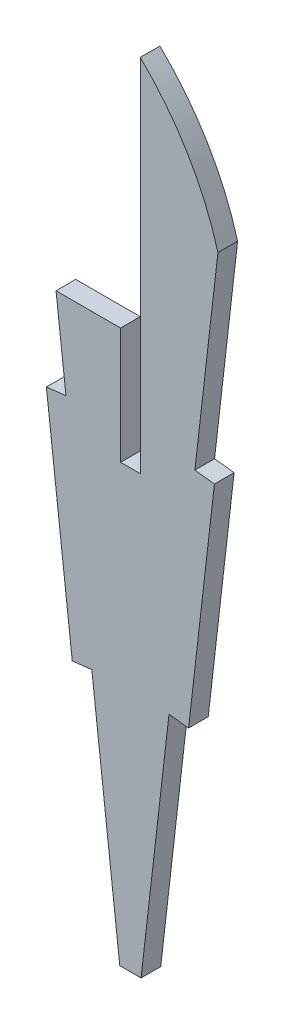
ISO-10303-21;
HEADER;
FILE_DESCRIPTION(('STEP AP214'),'2;1');
FILE_NAME('part.step','',(''),(''),'','','');
FILE_SCHEMA(('AUTOMOTIVE_DESIGN { 1 0 10303 214 1 1 1 1 }'));
ENDSEC;
DATA;
#1=APPLICATION_CONTEXT('core data for automotive mechanical design processes');
#2=APPLICATION_PROTOCOL_DEFINITION('international standard','automotive_design',2000,#1);
#3=PRODUCT_CONTEXT('',#1,'mechanical');
#4=PRODUCT('Part','Part','',(#3));
#5=PRODUCT_RELATED_PRODUCT_CATEGORY('part','',(#4));
#6=PRODUCT_DEFINITION_FORMATION('','',#4);
#7=PRODUCT_DEFINITION_CONTEXT('part definition',#1,'design');
#8=PRODUCT_DEFINITION('design','',#6,#7);
#9=PRODUCT_DEFINITION_SHAPE('','',#8);
#10=(LENGTH_UNIT() NAMED_UNIT(*) SI_UNIT(.MILLI.,.METRE.));
#11=(NAMED_UNIT(*) PLANE_ANGLE_UNIT() SI_UNIT($,.RADIAN.));
#12=(NAMED_UNIT(*) SI_UNIT($,.STERADIAN.) SOLID_ANGLE_UNIT());
#13=UNCERTAINTY_MEASURE_WITH_UNIT(LENGTH_MEASURE(1.E-05),#10,'distance_accuracy_value','');
#14=(GEOMETRIC_REPRESENTATION_CONTEXT(3) GLOBAL_UNCERTAINTY_ASSIGNED_CONTEXT((#13)) GLOBAL_UNIT_ASSIGNED_CONTEXT((#10,
#11,#12)) REPRESENTATION_CONTEXT('',''));
#15=CARTESIAN_POINT('',(0.,0.,0.));
#16=DIRECTION('',(0.,0.,1.));
#17=DIRECTION('',(1.,0.,0.));
#18=AXIS2_PLACEMENT_3D('',#15,#16,#17);
#19=CARTESIAN_POINT('',(-1.58511702127161,-218.846004156376,1.524));
#20=DIRECTION('',(0.,1.,0.));
#21=DIRECTION('',(0.,0.,1.));
#22=AXIS2_PLACEMENT_3D('',#19,#20,#21);
#23=PLANE('',#22);
#24=DIRECTION('',(1.,0.,0.));
#25=VECTOR('',#24,1.);
#26=CARTESIAN_POINT('',(-1.58511702127161,-218.846004156376,0.));
#27=LINE('',#26,#25);
#28=CARTESIAN_POINT('',(-1.58511702127161,-218.846004156376,0.));
#29=VERTEX_POINT('',#28);
#30=CARTESIAN_POINT('',(0.0611170212716098,-218.846004156376,0.));
#31=VERTEX_POINT('',#30);
#32=EDGE_CURVE('E187',#29,#31,#27,.T.);
#33=ORIENTED_EDGE('',*,*,#32,.T.);
#34=DIRECTION('',(0.,0.,-1.));
#35=VECTOR('',#34,1.);
#36=CARTESIAN_POINT('',(0.0611170212716098,-218.846004156376,1.524));
#37=LINE('',#36,#35);
#38=CARTESIAN_POINT('',(0.0611170212716098,-218.846004156376,1.524));
#39=VERTEX_POINT('',#38);
#40=EDGE_CURVE('E50',#39,#31,#37,.T.);
#41=ORIENTED_EDGE('',*,*,#40,.F.);
#42=DIRECTION('',(1.,0.,0.));
#43=VECTOR('',#42,1.);
#44=CARTESIAN_POINT('',(-1.58511702127161,-218.846004156376,1.524));
#45=LINE('',#44,#43);
#46=CARTESIAN_POINT('',(-1.58511702127161,-218.846004156376,1.524));
#47=VERTEX_POINT('',#46);
#48=EDGE_CURVE('E218',#47,#39,#45,.T.);
#49=ORIENTED_EDGE('',*,*,#48,.F.);
#50=DIRECTION('',(0.,0.,-1.));
#51=VECTOR('',#50,1.);
#52=CARTESIAN_POINT('',(-1.58511702127161,-218.846004156376,1.524));
#53=LINE('',#52,#51);
#54=EDGE_CURVE('E183',#47,#29,#53,.T.);
#55=ORIENTED_EDGE('',*,*,#54,.T.);
#56=EDGE_LOOP('',(#33,#41,#49,#55));
#57=FACE_BOUND('',#56,.T.);
#58=ADVANCED_FACE('F43',(#57),#23,.F.);
#59=CARTESIAN_POINT('',(2.22566948418233,-200.077957006271,1.524));
#60=DIRECTION('',(-0.993414910122723,0.114572319282901,0.));
#61=DIRECTION('',(-0.114572319282901,-0.993414910122723,0.));
#62=AXIS2_PLACEMENT_3D('',#59,#60,#61);
#63=PLANE('',#62);
#64=DIRECTION('',(0.114572319282901,0.993414910122723,0.));
#65=VECTOR('',#64,1.);
#66=CARTESIAN_POINT('',(2.22566948418233,-200.077957006271,0.));
#67=LINE('',#66,#65);
#68=CARTESIAN_POINT('',(2.22566948418233,-200.077957006271,0.));
#69=VERTEX_POINT('',#68);
#70=EDGE_CURVE('E190',#31,#69,#67,.T.);
#71=ORIENTED_EDGE('',*,*,#70,.T.);
#72=DIRECTION('',(0.,0.,-1.));
#73=VECTOR('',#72,1.);
#74=CARTESIAN_POINT('',(2.22566948418233,-200.077957006271,1.524));
#75=LINE('',#74,#73);
#76=CARTESIAN_POINT('',(2.22566948418233,-200.077957006271,1.524));
#77=VERTEX_POINT('',#76);
#78=EDGE_CURVE('E246',#77,#69,#75,.T.);
#79=ORIENTED_EDGE('',*,*,#78,.F.);
#80=DIRECTION('',(0.114572319282901,0.993414910122723,0.));
#81=VECTOR('',#80,1.);
#82=CARTESIAN_POINT('',(2.22566948418233,-200.077957006271,1.524));
#83=LINE('',#82,#81);
#84=EDGE_CURVE('E125',#39,#77,#83,.T.);
#85=ORIENTED_EDGE('',*,*,#84,.F.);
#86=ORIENTED_EDGE('',*,*,#40,.T.);
#87=EDGE_LOOP('',(#71,#79,#85,#86));
#88=FACE_BOUND('',#87,.T.);
#89=ADVANCED_FACE('F249',(#88),#63,.F.);
#90=CARTESIAN_POINT('',(2.22566948418233,-200.077957006271,1.524));
#91=DIRECTION('',(0.114572319282904,0.993414910122722,0.));
#92=DIRECTION('',(-0.993414910122722,0.114572319282904,0.));
#93=AXIS2_PLACEMENT_3D('',#90,#91,#92);
#94=PLANE('',#93);
#95=DIRECTION('',(0.993414910122722,-0.114572319282904,0.));
#96=VECTOR('',#95,1.);
#97=CARTESIAN_POINT('',(2.22566948418233,-200.077957006271,0.));
#98=LINE('',#97,#96);
#99=CARTESIAN_POINT('',(3.73963380720936,-200.252565220858,0.));
#100=VERTEX_POINT('',#99);
#101=EDGE_CURVE('E193',#69,#100,#98,.T.);
#102=ORIENTED_EDGE('',*,*,#101,.T.);
#103=DIRECTION('',(0.,0.,-1.));
#104=VECTOR('',#103,1.);
#105=CARTESIAN_POINT('',(3.73963380720936,-200.252565220858,1.524));
#106=LINE('',#105,#104);
#107=CARTESIAN_POINT('',(3.73963380720936,-200.252565220858,1.524));
#108=VERTEX_POINT('',#107);
#109=EDGE_CURVE('E243',#108,#100,#106,.T.);
#110=ORIENTED_EDGE('',*,*,#109,.F.);
#111=DIRECTION('',(0.993414910122722,-0.114572319282904,0.));
#112=VECTOR('',#111,1.);
#113=CARTESIAN_POINT('',(2.22566948418233,-200.077957006271,1.524));
#114=LINE('',#113,#112);
#115=EDGE_CURVE('E270',#77,#108,#114,.T.);
#116=ORIENTED_EDGE('',*,*,#115,.F.);
#117=ORIENTED_EDGE('',*,*,#78,.T.);
#118=EDGE_LOOP('',(#102,#110,#116,#117));
#119=FACE_BOUND('',#118,.T.);
#120=ADVANCED_FACE('F261',(#119),#94,.F.);
#121=CARTESIAN_POINT('',(5.74289991185404,-182.882973422829,1.524));
#122=DIRECTION('',(-0.993414910122723,0.114572319282902,0.));
#123=DIRECTION('',(-0.114572319282902,-0.993414910122723,0.));
#124=AXIS2_PLACEMENT_3D('',#121,#122,#123);
#125=PLANE('',#124);
#126=DIRECTION('',(0.114572319282902,0.993414910122722,0.));
#127=VECTOR('',#126,1.);
#128=CARTESIAN_POINT('',(5.74289991185404,-182.882973422829,0.));
#129=LINE('',#128,#127);
#130=CARTESIAN_POINT('',(5.74289991185404,-182.882973422829,0.));
#131=VERTEX_POINT('',#130);
#132=EDGE_CURVE('E195',#100,#131,#129,.T.);
#133=ORIENTED_EDGE('',*,*,#132,.T.);
#134=DIRECTION('',(0.,0.,-1.));
#135=VECTOR('',#134,1.);
#136=CARTESIAN_POINT('',(5.74289991185404,-182.882973422829,1.524));
#137=LINE('',#136,#135);
#138=CARTESIAN_POINT('',(5.74289991185404,-182.882973422829,1.524));
#139=VERTEX_POINT('',#138);
#140=EDGE_CURVE('E240',#139,#131,#137,.T.);
#141=ORIENTED_EDGE('',*,*,#140,.F.);
#142=DIRECTION('',(0.114572319282902,0.993414910122722,0.));
#143=VECTOR('',#142,1.);
#144=CARTESIAN_POINT('',(5.74289991185404,-182.882973422829,1.524));
#145=LINE('',#144,#143);
#146=EDGE_CURVE('E267',#108,#139,#145,.T.);
#147=ORIENTED_EDGE('',*,*,#146,.F.);
#148=ORIENTED_EDGE('',*,*,#109,.T.);
#149=EDGE_LOOP('',(#133,#141,#147,#148));
#150=FACE_BOUND('',#149,.T.);
#151=ADVANCED_FACE('F265',(#150),#125,.F.);
#152=CARTESIAN_POINT('',(4.228935588827,-182.708365208241,1.524));
#153=DIRECTION('',(-0.114572319282922,-0.99341491012272,0.));
#154=DIRECTION('',(0.99341491012272,-0.114572319282922,0.));
#155=AXIS2_PLACEMENT_3D('',#152,#153,#154);
#156=PLANE('',#155);
#157=DIRECTION('',(-0.99341491012272,0.114572319282922,0.));
#158=VECTOR('',#157,1.);
#159=CARTESIAN_POINT('',(4.228935588827,-182.708365208241,0.));
#160=LINE('',#159,#158);
#161=CARTESIAN_POINT('',(4.228935588827,-182.708365208241,0.));
#162=VERTEX_POINT('',#161);
#163=EDGE_CURVE('E197',#131,#162,#160,.T.);
#164=ORIENTED_EDGE('',*,*,#163,.T.);
#165=DIRECTION('',(0.,0.,-1.));
#166=VECTOR('',#165,1.);
#167=CARTESIAN_POINT('',(4.228935588827,-182.708365208241,1.524));
#168=LINE('',#167,#166);
#169=CARTESIAN_POINT('',(4.228935588827,-182.708365208241,1.524));
#170=VERTEX_POINT('',#169);
#171=EDGE_CURVE('E237',#170,#162,#168,.T.);
#172=ORIENTED_EDGE('',*,*,#171,.F.);
#173=DIRECTION('',(-0.99341491012272,0.114572319282922,0.));
#174=VECTOR('',#173,1.);
#175=CARTESIAN_POINT('',(4.228935588827,-182.708365208241,1.524));
#176=LINE('',#175,#174);
#177=EDGE_CURVE('E269',#139,#170,#176,.T.);
#178=ORIENTED_EDGE('',*,*,#177,.F.);
#179=ORIENTED_EDGE('',*,*,#140,.T.);
#180=EDGE_LOOP('',(#164,#172,#178,#179));
#181=FACE_BOUND('',#180,.T.);
#182=ADVANCED_FACE('F333',(#181),#156,.F.);
#183=CARTESIAN_POINT('',(6.01355397832156,-167.23458822529,1.524));
#184=DIRECTION('',(-0.993414910122723,0.114572319282901,0.));
#185=DIRECTION('',(-0.114572319282901,-0.993414910122723,0.));
#186=AXIS2_PLACEMENT_3D('',#183,#184,#185);
#187=PLANE('',#186);
#188=DIRECTION('',(0.114572319282901,0.993414910122723,0.));
#189=VECTOR('',#188,1.);
#190=CARTESIAN_POINT('',(6.01355397832156,-167.23458822529,0.));
#191=LINE('',#190,#189);
#192=CARTESIAN_POINT('',(6.01355397832155,-167.23458822529,0.));
#193=VERTEX_POINT('',#192);
#194=EDGE_CURVE('E199',#162,#193,#191,.T.);
#195=ORIENTED_EDGE('',*,*,#194,.T.);
#196=DIRECTION('',(0.,0.,-1.));
#197=VECTOR('',#196,1.);
#198=CARTESIAN_POINT('',(6.01355397832155,-167.23458822529,1.524));
#199=LINE('',#198,#197);
#200=CARTESIAN_POINT('',(6.01355397832155,-167.23458822529,1.524));
#201=VERTEX_POINT('',#200);
#202=EDGE_CURVE('E234',#201,#193,#199,.T.);
#203=ORIENTED_EDGE('',*,*,#202,.F.);
#204=DIRECTION('',(0.114572319282901,0.993414910122723,0.));
#205=VECTOR('',#204,1.);
#206=CARTESIAN_POINT('',(6.01355397832156,-167.23458822529,1.524));
#207=LINE('',#206,#205);
#208=EDGE_CURVE('E272',#170,#201,#207,.T.);
#209=ORIENTED_EDGE('',*,*,#208,.F.);
#210=ORIENTED_EDGE('',*,*,#171,.T.);
#211=EDGE_LOOP('',(#195,#203,#209,#210));
#212=FACE_BOUND('',#211,.T.);
#213=ADVANCED_FACE('F330',(#212),#187,.F.);
#214=CARTESIAN_POINT('',(-15.559815132406,-173.267487686723,1.524));
#215=DIRECTION('',(0.,0.,-1.));
#216=DIRECTION('',(-1.,0.,0.));
#217=AXIS2_PLACEMENT_3D('',#214,#215,#216);
#218=CYLINDRICAL_SURFACE('',#217,22.4010296794468);
#219=CARTESIAN_POINT('',(-15.559815132406,-173.267487686723,0.));
#220=DIRECTION('',(0.,0.,1.));
#221=DIRECTION('',(1.,0.,0.));
#222=AXIS2_PLACEMENT_3D('',#219,#220,#221);
#223=CIRCLE('',#222,22.4010296794468);
#224=CARTESIAN_POINT('',(0.,-157.152330729846,0.));
#225=VERTEX_POINT('',#224);
#226=EDGE_CURVE('E201',#193,#225,#223,.T.);
#227=ORIENTED_EDGE('',*,*,#226,.T.);
#228=DIRECTION('',(0.,0.,-1.));
#229=VECTOR('',#228,1.);
#230=CARTESIAN_POINT('',(0.,-157.152330729846,1.524));
#231=LINE('',#230,#229);
#232=CARTESIAN_POINT('',(0.,-157.152330729846,1.524));
#233=VERTEX_POINT('',#232);
#234=EDGE_CURVE('E231',#233,#225,#231,.T.);
#235=ORIENTED_EDGE('',*,*,#234,.F.);
#236=CARTESIAN_POINT('',(-15.559815132406,-173.267487686723,1.524));
#237=DIRECTION('',(0.,0.,1.));
#238=DIRECTION('',(1.,0.,0.));
#239=AXIS2_PLACEMENT_3D('',#236,#237,#238);
#240=CIRCLE('',#239,22.4010296794468);
#241=EDGE_CURVE('E278',#201,#233,#240,.T.);
#242=ORIENTED_EDGE('',*,*,#241,.F.);
#243=ORIENTED_EDGE('',*,*,#202,.T.);
#244=EDGE_LOOP('',(#227,#235,#242,#243));
#245=FACE_BOUND('',#244,.T.);
#246=ADVANCED_FACE('F326',(#245),#218,.T.);
#247=CARTESIAN_POINT('',(0.,-185.062075143658,1.524));
#248=DIRECTION('',(1.,0.,0.));
#249=DIRECTION('',(0.,1.,0.));
#250=AXIS2_PLACEMENT_3D('',#247,#248,#249);
#251=PLANE('',#250);
#252=DIRECTION('',(0.,-1.,0.));
#253=VECTOR('',#252,1.);
#254=CARTESIAN_POINT('',(0.,-185.062075143658,0.));
#255=LINE('',#254,#253);
#256=CARTESIAN_POINT('',(0.,-185.062075143658,0.));
#257=VERTEX_POINT('',#256);
#258=EDGE_CURVE('E203',#225,#257,#255,.T.);
#259=ORIENTED_EDGE('',*,*,#258,.T.);
#260=DIRECTION('',(0.,0.,-1.));
#261=VECTOR('',#260,1.);
#262=CARTESIAN_POINT('',(0.,-185.062075143658,1.524));
#263=LINE('',#262,#261);
#264=CARTESIAN_POINT('',(0.,-185.062075143658,1.524));
#265=VERTEX_POINT('',#264);
#266=EDGE_CURVE('E228',#265,#257,#263,.T.);
#267=ORIENTED_EDGE('',*,*,#266,.F.);
#268=DIRECTION('',(0.,-1.,0.));
#269=VECTOR('',#268,1.);
#270=CARTESIAN_POINT('',(0.,-185.062075143658,1.524));
#271=LINE('',#270,#269);
#272=EDGE_CURVE('E280',#233,#265,#271,.T.);
#273=ORIENTED_EDGE('',*,*,#272,.F.);
#274=ORIENTED_EDGE('',*,*,#234,.T.);
#275=EDGE_LOOP('',(#259,#267,#273,#274));
#276=FACE_BOUND('',#275,.T.);
#277=ADVANCED_FACE('F322',(#276),#251,.F.);
#278=CARTESIAN_POINT('',(0.,-185.062075143658,1.524));
#279=DIRECTION('',(0.,-1.,0.));
#280=DIRECTION('',(0.,0.,-1.));
#281=AXIS2_PLACEMENT_3D('',#278,#279,#280);
#282=PLANE('',#281);
#283=DIRECTION('',(-1.,0.,0.));
#284=VECTOR('',#283,1.);
#285=CARTESIAN_POINT('',(0.,-185.062075143658,0.));
#286=LINE('',#285,#284);
#287=CARTESIAN_POINT('',(-1.524,-185.062075143658,0.));
#288=VERTEX_POINT('',#287);
#289=EDGE_CURVE('E205',#257,#288,#286,.T.);
#290=ORIENTED_EDGE('',*,*,#289,.T.);
#291=DIRECTION('',(0.,0.,-1.));
#292=VECTOR('',#291,1.);
#293=CARTESIAN_POINT('',(-1.524,-185.062075143658,1.524));
#294=LINE('',#293,#292);
#295=CARTESIAN_POINT('',(-1.524,-185.062075143658,1.524));
#296=VERTEX_POINT('',#295);
#297=EDGE_CURVE('E225',#296,#288,#294,.T.);
#298=ORIENTED_EDGE('',*,*,#297,.F.);
#299=DIRECTION('',(-1.,0.,0.));
#300=VECTOR('',#299,1.);
#301=CARTESIAN_POINT('',(0.,-185.062075143658,1.524));
#302=LINE('',#301,#300);
#303=EDGE_CURVE('E282',#265,#296,#302,.T.);
#304=ORIENTED_EDGE('',*,*,#303,.F.);
#305=ORIENTED_EDGE('',*,*,#266,.T.);
#306=EDGE_LOOP('',(#290,#298,#304,#305));
#307=FACE_BOUND('',#306,.T.);
#308=ADVANCED_FACE('F316',(#307),#282,.F.);
#309=CARTESIAN_POINT('',(-1.524,-185.062075143658,1.524));
#310=DIRECTION('',(-1.,0.,0.));
#311=DIRECTION('',(0.,-1.,0.));
#312=AXIS2_PLACEMENT_3D('',#309,#310,#311);
#313=PLANE('',#312);
#314=DIRECTION('',(0.,1.,0.));
#315=VECTOR('',#314,1.);
#316=CARTESIAN_POINT('',(-1.524,-185.062075143658,0.));
#317=LINE('',#316,#315);
#318=CARTESIAN_POINT('',(-1.524,-176.059169336281,0.));
#319=VERTEX_POINT('',#318);
#320=EDGE_CURVE('E207',#288,#319,#317,.T.);
#321=ORIENTED_EDGE('',*,*,#320,.T.);
#322=DIRECTION('',(0.,0.,1.));
#323=VECTOR('',#322,1.);
#324=CARTESIAN_POINT('',(-1.524,-176.059169336281,0.));
#325=LINE('',#324,#323);
#326=CARTESIAN_POINT('',(-1.524,-176.059169336281,1.524));
#327=VERTEX_POINT('',#326);
#328=EDGE_CURVE('E57',#319,#327,#325,.T.);
#329=ORIENTED_EDGE('',*,*,#328,.T.);
#330=DIRECTION('',(0.,1.,0.));
#331=VECTOR('',#330,1.);
#332=CARTESIAN_POINT('',(-1.524,-185.062075143658,1.524));
#333=LINE('',#332,#331);
#334=EDGE_CURVE('E284',#296,#327,#333,.T.);
#335=ORIENTED_EDGE('',*,*,#334,.F.);
#336=ORIENTED_EDGE('',*,*,#297,.T.);
#337=EDGE_LOOP('',(#321,#329,#335,#336));
#338=FACE_BOUND('',#337,.T.);
#339=ADVANCED_FACE('F309',(#338),#313,.F.);
#340=CARTESIAN_POINT('',(-7.53755397832156,-167.23458822529,1.524));
#341=DIRECTION('',(0.993414910122723,0.114572319282901,0.));
#342=DIRECTION('',(-0.114572319282901,0.993414910122723,0.));
#343=AXIS2_PLACEMENT_3D('',#340,#341,#342);
#344=PLANE('',#343);
#345=DIRECTION('',(0.114572319282901,-0.993414910122723,0.));
#346=VECTOR('',#345,1.);
#347=CARTESIAN_POINT('',(-7.53755397832156,-167.23458822529,1.524));
#348=LINE('',#347,#346);
#349=CARTESIAN_POINT('',(-6.51979924735891,-176.059169336281,1.524));
#350=VERTEX_POINT('',#349);
#351=CARTESIAN_POINT('',(-5.75293558882701,-182.708365208241,1.524));
#352=VERTEX_POINT('',#351);
#353=EDGE_CURVE('E287',#350,#352,#348,.T.);
#354=ORIENTED_EDGE('',*,*,#353,.F.);
#355=DIRECTION('',(0.,0.,-1.));
#356=VECTOR('',#355,1.);
#357=CARTESIAN_POINT('',(-6.51979924735892,-176.059169336281,1.524));
#358=LINE('',#357,#356);
#359=CARTESIAN_POINT('',(-6.51979924735891,-176.059169336281,0.));
#360=VERTEX_POINT('',#359);
#361=EDGE_CURVE('E191',#350,#360,#358,.T.);
#362=ORIENTED_EDGE('',*,*,#361,.T.);
#363=DIRECTION('',(0.114572319282901,-0.993414910122723,0.));
#364=VECTOR('',#363,1.);
#365=CARTESIAN_POINT('',(-7.53755397832156,-167.23458822529,0.));
#366=LINE('',#365,#364);
#367=CARTESIAN_POINT('',(-5.75293558882701,-182.708365208241,0.));
#368=VERTEX_POINT('',#367);
#369=EDGE_CURVE('E210',#360,#368,#366,.T.);
#370=ORIENTED_EDGE('',*,*,#369,.T.);
#371=DIRECTION('',(0.,0.,-1.));
#372=VECTOR('',#371,1.);
#373=CARTESIAN_POINT('',(-5.75293558882701,-182.708365208241,1.524));
#374=LINE('',#373,#372);
#375=EDGE_CURVE('E222',#352,#368,#374,.T.);
#376=ORIENTED_EDGE('',*,*,#375,.F.);
#377=EDGE_LOOP('',(#354,#362,#370,#376));
#378=FACE_BOUND('',#377,.T.);
#379=ADVANCED_FACE('F294',(#378),#344,.F.);
#380=CARTESIAN_POINT('',(-5.75293558882701,-182.708365208241,1.524));
#381=DIRECTION('',(0.114572319282922,-0.99341491012272,0.));
#382=DIRECTION('',(0.99341491012272,0.114572319282922,0.));
#383=AXIS2_PLACEMENT_3D('',#380,#381,#382);
#384=PLANE('',#383);
#385=DIRECTION('',(-0.99341491012272,-0.114572319282922,0.));
#386=VECTOR('',#385,1.);
#387=CARTESIAN_POINT('',(-5.75293558882701,-182.708365208241,0.));
#388=LINE('',#387,#386);
#389=CARTESIAN_POINT('',(-7.26689991185404,-182.882973422829,0.));
#390=VERTEX_POINT('',#389);
#391=EDGE_CURVE('E212',#368,#390,#388,.T.);
#392=ORIENTED_EDGE('',*,*,#391,.T.);
#393=DIRECTION('',(0.,0.,-1.));
#394=VECTOR('',#393,1.);
#395=CARTESIAN_POINT('',(-7.26689991185404,-182.882973422829,1.524));
#396=LINE('',#395,#394);
#397=CARTESIAN_POINT('',(-7.26689991185404,-182.882973422829,1.524));
#398=VERTEX_POINT('',#397);
#399=EDGE_CURVE('E178',#398,#390,#396,.T.);
#400=ORIENTED_EDGE('',*,*,#399,.F.);
#401=DIRECTION('',(-0.99341491012272,-0.114572319282922,0.));
#402=VECTOR('',#401,1.);
#403=CARTESIAN_POINT('',(-5.75293558882701,-182.708365208241,1.524));
#404=LINE('',#403,#402);
#405=EDGE_CURVE('E166',#352,#398,#404,.T.);
#406=ORIENTED_EDGE('',*,*,#405,.F.);
#407=ORIENTED_EDGE('',*,*,#375,.T.);
#408=EDGE_LOOP('',(#392,#400,#406,#407));
#409=FACE_BOUND('',#408,.T.);
#410=ADVANCED_FACE('F297',(#409),#384,.F.);
#411=CARTESIAN_POINT('',(-7.26689991185404,-182.882973422829,1.524));
#412=DIRECTION('',(0.993414910122723,0.114572319282902,0.));
#413=DIRECTION('',(-0.114572319282902,0.993414910122723,0.));
#414=AXIS2_PLACEMENT_3D('',#411,#412,#413);
#415=PLANE('',#414);
#416=DIRECTION('',(0.114572319282902,-0.993414910122722,0.));
#417=VECTOR('',#416,1.);
#418=CARTESIAN_POINT('',(-7.26689991185404,-182.882973422829,0.));
#419=LINE('',#418,#417);
#420=CARTESIAN_POINT('',(-5.26363380720937,-200.252565220858,0.));
#421=VERTEX_POINT('',#420);
#422=EDGE_CURVE('E175',#390,#421,#419,.T.);
#423=ORIENTED_EDGE('',*,*,#422,.T.);
#424=DIRECTION('',(0.,0.,-1.));
#425=VECTOR('',#424,1.);
#426=CARTESIAN_POINT('',(-5.26363380720937,-200.252565220858,1.524));
#427=LINE('',#426,#425);
#428=CARTESIAN_POINT('',(-5.26363380720937,-200.252565220858,1.524));
#429=VERTEX_POINT('',#428);
#430=EDGE_CURVE('E172',#429,#421,#427,.T.);
#431=ORIENTED_EDGE('',*,*,#430,.F.);
#432=DIRECTION('',(0.114572319282902,-0.993414910122722,0.));
#433=VECTOR('',#432,1.);
#434=CARTESIAN_POINT('',(-7.26689991185404,-182.882973422829,1.524));
#435=LINE('',#434,#433);
#436=EDGE_CURVE('E158',#398,#429,#435,.T.);
#437=ORIENTED_EDGE('',*,*,#436,.F.);
#438=ORIENTED_EDGE('',*,*,#399,.T.);
#439=EDGE_LOOP('',(#423,#431,#437,#438));
#440=FACE_BOUND('',#439,.T.);
#441=ADVANCED_FACE('F173',(#440),#415,.F.);
#442=CARTESIAN_POINT('',(-3.74966948418234,-200.077957006271,1.524));
#443=DIRECTION('',(-0.114572319282904,0.993414910122722,0.));
#444=DIRECTION('',(-0.993414910122722,-0.114572319282904,0.));
#445=AXIS2_PLACEMENT_3D('',#442,#443,#444);
#446=PLANE('',#445);
#447=DIRECTION('',(0.993414910122722,0.114572319282904,0.));
#448=VECTOR('',#447,1.);
#449=CARTESIAN_POINT('',(-3.74966948418234,-200.077957006271,0.));
#450=LINE('',#449,#448);
#451=CARTESIAN_POINT('',(-3.74966948418234,-200.077957006271,0.));
#452=VERTEX_POINT('',#451);
#453=EDGE_CURVE('E215',#421,#452,#450,.T.);
#454=ORIENTED_EDGE('',*,*,#453,.T.);
#455=DIRECTION('',(0.,0.,-1.));
#456=VECTOR('',#455,1.);
#457=CARTESIAN_POINT('',(-3.74966948418234,-200.077957006271,1.524));
#458=LINE('',#457,#456);
#459=CARTESIAN_POINT('',(-3.74966948418234,-200.077957006271,1.524));
#460=VERTEX_POINT('',#459);
#461=EDGE_CURVE('E179',#460,#452,#458,.T.);
#462=ORIENTED_EDGE('',*,*,#461,.F.);
#463=DIRECTION('',(0.993414910122722,0.114572319282904,0.));
#464=VECTOR('',#463,1.);
#465=CARTESIAN_POINT('',(-3.74966948418234,-200.077957006271,1.524));
#466=LINE('',#465,#464);
#467=EDGE_CURVE('E163',#429,#460,#466,.T.);
#468=ORIENTED_EDGE('',*,*,#467,.F.);
#469=ORIENTED_EDGE('',*,*,#430,.T.);
#470=EDGE_LOOP('',(#454,#462,#468,#469));
#471=FACE_BOUND('',#470,.T.);
#472=ADVANCED_FACE('F181',(#471),#446,.F.);
#473=CARTESIAN_POINT('',(-3.74966948418234,-200.077957006271,1.524));
#474=DIRECTION('',(0.993414910122723,0.114572319282902,0.));
#475=DIRECTION('',(-0.114572319282902,0.993414910122723,0.));
#476=AXIS2_PLACEMENT_3D('',#473,#474,#475);
#477=PLANE('',#476);
#478=DIRECTION('',(0.114572319282902,-0.993414910122723,0.));
#479=VECTOR('',#478,1.);
#480=CARTESIAN_POINT('',(-3.74966948418234,-200.077957006271,0.));
#481=LINE('',#480,#479);
#482=EDGE_CURVE('E116',#452,#29,#481,.T.);
#483=ORIENTED_EDGE('',*,*,#482,.T.);
#484=ORIENTED_EDGE('',*,*,#54,.F.);
#485=DIRECTION('',(0.114572319282902,-0.993414910122723,0.));
#486=VECTOR('',#485,1.);
#487=CARTESIAN_POINT('',(-3.74966948418234,-200.077957006271,1.524));
#488=LINE('',#487,#486);
#489=EDGE_CURVE('E65',#460,#47,#488,.T.);
#490=ORIENTED_EDGE('',*,*,#489,.F.);
#491=ORIENTED_EDGE('',*,*,#461,.T.);
#492=EDGE_LOOP('',(#483,#484,#490,#491));
#493=FACE_BOUND('',#492,.T.);
#494=ADVANCED_FACE('F298',(#493),#477,.F.);
#495=CARTESIAN_POINT('',(-15.559815132406,-173.267487686723,1.524));
#496=DIRECTION('',(0.,0.,1.));
#497=DIRECTION('',(1.,0.,0.));
#498=AXIS2_PLACEMENT_3D('',#495,#496,#497);
#499=PLANE('',#498);
#500=DIRECTION('',(1.,0.,0.));
#501=VECTOR('',#500,1.);
#502=CARTESIAN_POINT('',(-1.524,-176.059169336281,1.524));
#503=LINE('',#502,#501);
#504=EDGE_CURVE('E291',#350,#327,#503,.T.);
#505=ORIENTED_EDGE('',*,*,#504,.F.);
#506=ORIENTED_EDGE('',*,*,#353,.T.);
#507=ORIENTED_EDGE('',*,*,#405,.T.);
#508=ORIENTED_EDGE('',*,*,#436,.T.);
#509=ORIENTED_EDGE('',*,*,#467,.T.);
#510=ORIENTED_EDGE('',*,*,#489,.T.);
#511=ORIENTED_EDGE('',*,*,#48,.T.);
#512=ORIENTED_EDGE('',*,*,#84,.T.);
#513=ORIENTED_EDGE('',*,*,#115,.T.);
#514=ORIENTED_EDGE('',*,*,#146,.T.);
#515=ORIENTED_EDGE('',*,*,#177,.T.);
#516=ORIENTED_EDGE('',*,*,#208,.T.);
#517=ORIENTED_EDGE('',*,*,#241,.T.);
#518=ORIENTED_EDGE('',*,*,#272,.T.);
#519=ORIENTED_EDGE('',*,*,#303,.T.);
#520=ORIENTED_EDGE('',*,*,#334,.T.);
#521=EDGE_LOOP('',(#505,#506,#507,#508,#509,#510,#511,#512,#513,#514,#515,#516,#517,#518,#519,#520));
#522=FACE_BOUND('',#521,.T.);
#523=ADVANCED_FACE('F161',(#522),#499,.T.);
#524=CARTESIAN_POINT('',(-15.559815132406,-173.267487686723,0.));
#525=DIRECTION('',(0.,0.,1.));
#526=DIRECTION('',(1.,0.,0.));
#527=AXIS2_PLACEMENT_3D('',#524,#525,#526);
#528=PLANE('',#527);
#529=ORIENTED_EDGE('',*,*,#369,.F.);
#530=DIRECTION('',(1.,0.,0.));
#531=VECTOR('',#530,1.);
#532=CARTESIAN_POINT('',(-15.559815132406,-176.059169336281,0.));
#533=LINE('',#532,#531);
#534=EDGE_CURVE('E11',#360,#319,#533,.T.);
#535=ORIENTED_EDGE('',*,*,#534,.T.);
#536=ORIENTED_EDGE('',*,*,#320,.F.);
#537=ORIENTED_EDGE('',*,*,#289,.F.);
#538=ORIENTED_EDGE('',*,*,#258,.F.);
#539=ORIENTED_EDGE('',*,*,#226,.F.);
#540=ORIENTED_EDGE('',*,*,#194,.F.);
#541=ORIENTED_EDGE('',*,*,#163,.F.);
#542=ORIENTED_EDGE('',*,*,#132,.F.);
#543=ORIENTED_EDGE('',*,*,#101,.F.);
#544=ORIENTED_EDGE('',*,*,#70,.F.);
#545=ORIENTED_EDGE('',*,*,#32,.F.);
#546=ORIENTED_EDGE('',*,*,#482,.F.);
#547=ORIENTED_EDGE('',*,*,#453,.F.);
#548=ORIENTED_EDGE('',*,*,#422,.F.);
#549=ORIENTED_EDGE('',*,*,#391,.F.);
#550=EDGE_LOOP('',(#529,#535,#536,#537,#538,#539,#540,#541,#542,#543,#544,#545,#546,#547,#548,#549));
#551=FACE_BOUND('',#550,.T.);
#552=ADVANCED_FACE('F255',(#551),#528,.F.);
#553=CARTESIAN_POINT('',(-1.524,-176.059169336281,0.));
#554=DIRECTION('',(0.,-1.,0.));
#555=DIRECTION('',(0.,0.,-1.));
#556=AXIS2_PLACEMENT_3D('',#553,#554,#555);
#557=PLANE('',#556);
#558=ORIENTED_EDGE('',*,*,#504,.T.);
#559=ORIENTED_EDGE('',*,*,#328,.F.);
#560=ORIENTED_EDGE('',*,*,#534,.F.);
#561=ORIENTED_EDGE('',*,*,#361,.F.);
#562=EDGE_LOOP('',(#558,#559,#560,#561));
#563=FACE_BOUND('',#562,.T.);
#564=ADVANCED_FACE('F305',(#563),#557,.F.);
#565=CLOSED_SHELL('',(#58,#89,#120,#151,#182,#213,#246,#277,#308,#339,#379,#410,#441,#472,#494,
#523,#552,#564));
#566=MANIFOLD_SOLID_BREP('B2',#565);
#567=ADVANCED_BREP_SHAPE_REPRESENTATION('',(#18,#566),#14);
#568=SHAPE_DEFINITION_REPRESENTATION(#9,#567);
ENDSEC;
END-ISO-10303-21;
